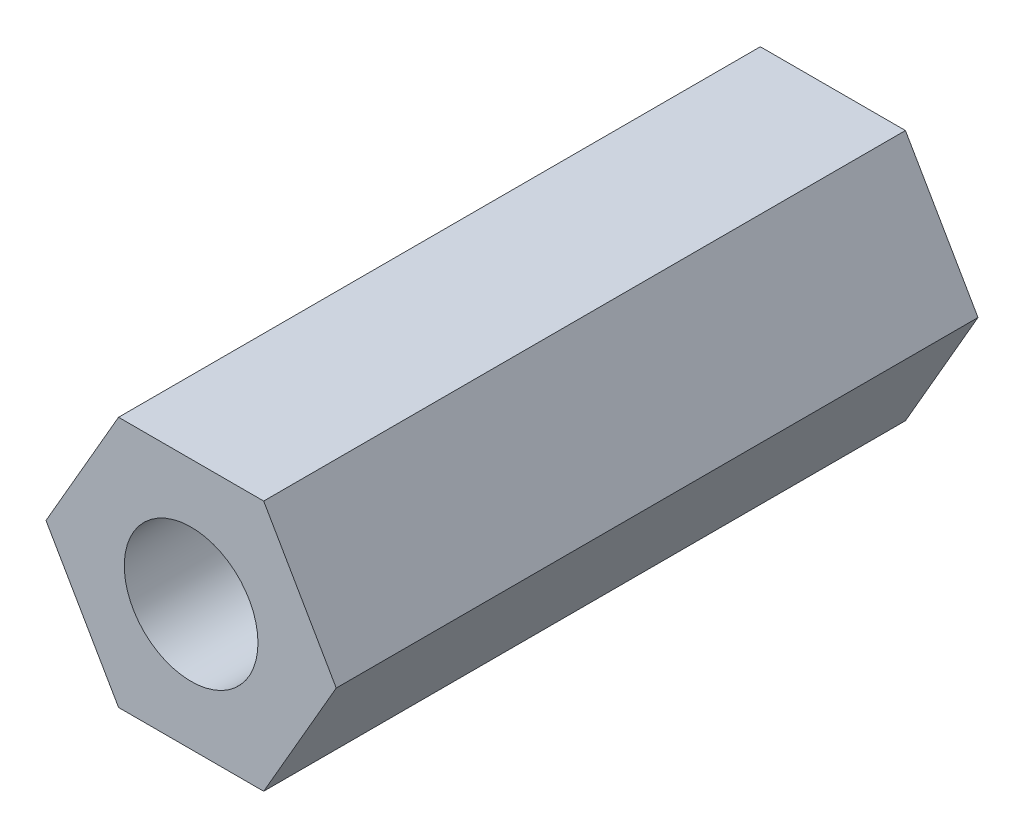
ISO-10303-21;
HEADER;
FILE_DESCRIPTION(('STEP AP214'),'2;1');
FILE_NAME('part.step','',(''),(''),'','','');
FILE_SCHEMA(('AUTOMOTIVE_DESIGN { 1 0 10303 214 1 1 1 1 }'));
ENDSEC;
DATA;
#1=APPLICATION_CONTEXT('core data for automotive mechanical design processes');
#2=APPLICATION_PROTOCOL_DEFINITION('international standard','automotive_design',2000,#1);
#3=PRODUCT_CONTEXT('',#1,'mechanical');
#4=PRODUCT('Part','Part','',(#3));
#5=PRODUCT_RELATED_PRODUCT_CATEGORY('part','',(#4));
#6=PRODUCT_DEFINITION_FORMATION('','',#4);
#7=PRODUCT_DEFINITION_CONTEXT('part definition',#1,'design');
#8=PRODUCT_DEFINITION('design','',#6,#7);
#9=PRODUCT_DEFINITION_SHAPE('','',#8);
#10=(LENGTH_UNIT() NAMED_UNIT(*) SI_UNIT(.MILLI.,.METRE.));
#11=(NAMED_UNIT(*) PLANE_ANGLE_UNIT() SI_UNIT($,.RADIAN.));
#12=(NAMED_UNIT(*) SI_UNIT($,.STERADIAN.) SOLID_ANGLE_UNIT());
#13=UNCERTAINTY_MEASURE_WITH_UNIT(LENGTH_MEASURE(1.E-05),#10,'distance_accuracy_value','');
#14=(GEOMETRIC_REPRESENTATION_CONTEXT(3) GLOBAL_UNCERTAINTY_ASSIGNED_CONTEXT((#13)) GLOBAL_UNIT_ASSIGNED_CONTEXT((#10,
#11,#12)) REPRESENTATION_CONTEXT('',''));
#15=CARTESIAN_POINT('',(0.,0.,0.));
#16=DIRECTION('',(0.,0.,1.));
#17=DIRECTION('',(1.,0.,0.));
#18=AXIS2_PLACEMENT_3D('',#15,#16,#17);
#19=CARTESIAN_POINT('',(0.,0.,12.));
#20=DIRECTION('',(0.,0.,1.));
#21=DIRECTION('',(1.,0.,0.));
#22=AXIS2_PLACEMENT_3D('',#19,#20,#21);
#23=PLANE('',#22);
#24=DIRECTION('',(0.499999999999995,0.866025403784441,0.));
#25=VECTOR('',#24,1.);
#26=CARTESIAN_POINT('',(1.35677313259565,-2.34999999999998,12.));
#27=LINE('',#26,#25);
#28=CARTESIAN_POINT('',(1.35677313259565,-2.34999999999998,12.));
#29=VERTEX_POINT('',#28);
#30=CARTESIAN_POINT('',(2.71354626519124,0.,12.));
#31=VERTEX_POINT('',#30);
#32=EDGE_CURVE('E129',#29,#31,#27,.T.);
#33=ORIENTED_EDGE('',*,*,#32,.T.);
#34=DIRECTION('',(-0.500000000000001,0.866025403784438,0.));
#35=VECTOR('',#34,1.);
#36=CARTESIAN_POINT('',(2.71354626519124,0.,12.));
#37=LINE('',#36,#35);
#38=CARTESIAN_POINT('',(1.35677313259561,2.35,12.));
#39=VERTEX_POINT('',#38);
#40=EDGE_CURVE('E87',#31,#39,#37,.T.);
#41=ORIENTED_EDGE('',*,*,#40,.T.);
#42=DIRECTION('',(-1.,0.,0.));
#43=VECTOR('',#42,1.);
#44=CARTESIAN_POINT('',(1.35677313259561,2.35,12.));
#45=LINE('',#44,#43);
#46=CARTESIAN_POINT('',(-1.35677313259563,2.34999999999999,12.));
#47=VERTEX_POINT('',#46);
#48=EDGE_CURVE('E100',#39,#47,#45,.T.);
#49=ORIENTED_EDGE('',*,*,#48,.T.);
#50=DIRECTION('',(-0.499999999999995,-0.866025403784441,0.));
#51=VECTOR('',#50,1.);
#52=CARTESIAN_POINT('',(-1.35677313259563,2.34999999999999,12.));
#53=LINE('',#52,#51);
#54=CARTESIAN_POINT('',(-2.71354626519124,0.,12.));
#55=VERTEX_POINT('',#54);
#56=EDGE_CURVE('E94',#47,#55,#53,.T.);
#57=ORIENTED_EDGE('',*,*,#56,.T.);
#58=DIRECTION('',(0.500000000000007,-0.866025403784435,0.));
#59=VECTOR('',#58,1.);
#60=CARTESIAN_POINT('',(-2.71354626519124,0.,12.));
#61=LINE('',#60,#59);
#62=CARTESIAN_POINT('',(-1.3567731325956,-2.35000000000001,12.));
#63=VERTEX_POINT('',#62);
#64=EDGE_CURVE('E98',#55,#63,#61,.T.);
#65=ORIENTED_EDGE('',*,*,#64,.T.);
#66=DIRECTION('',(1.,0.,0.));
#67=VECTOR('',#66,1.);
#68=CARTESIAN_POINT('',(-1.3567731325956,-2.35000000000001,12.));
#69=LINE('',#68,#67);
#70=EDGE_CURVE('E50',#63,#29,#69,.T.);
#71=ORIENTED_EDGE('',*,*,#70,.T.);
#72=EDGE_LOOP('',(#33,#41,#49,#57,#65,#71));
#73=FACE_BOUND('',#72,.T.);
#74=CARTESIAN_POINT('',(0.,0.,12.));
#75=DIRECTION('',(0.,0.,1.));
#76=DIRECTION('',(1.,0.,0.));
#77=AXIS2_PLACEMENT_3D('',#74,#75,#76);
#78=CIRCLE('',#77,1.25);
#79=CARTESIAN_POINT('',(1.25,0.,12.));
#80=VERTEX_POINT('',#79);
#81=EDGE_CURVE('E122',#80,#80,#78,.T.);
#82=ORIENTED_EDGE('',*,*,#81,.F.);
#83=EDGE_LOOP('',(#82));
#84=FACE_BOUND('',#83,.T.);
#85=ADVANCED_FACE('F33',(#73,#84),#23,.T.);
#86=CARTESIAN_POINT('',(0.,0.,0.));
#87=DIRECTION('',(0.,0.,1.));
#88=DIRECTION('',(1.,0.,0.));
#89=AXIS2_PLACEMENT_3D('',#86,#87,#88);
#90=PLANE('',#89);
#91=DIRECTION('',(0.499999999999995,0.866025403784441,0.));
#92=VECTOR('',#91,1.);
#93=CARTESIAN_POINT('',(1.35677313259565,-2.34999999999998,0.));
#94=LINE('',#93,#92);
#95=CARTESIAN_POINT('',(1.35677313259565,-2.34999999999998,0.));
#96=VERTEX_POINT('',#95);
#97=CARTESIAN_POINT('',(2.71354626519124,0.,0.));
#98=VERTEX_POINT('',#97);
#99=EDGE_CURVE('E118',#96,#98,#94,.T.);
#100=ORIENTED_EDGE('',*,*,#99,.F.);
#101=DIRECTION('',(1.,0.,0.));
#102=VECTOR('',#101,1.);
#103=CARTESIAN_POINT('',(-1.3567731325956,-2.35000000000001,0.));
#104=LINE('',#103,#102);
#105=CARTESIAN_POINT('',(-1.3567731325956,-2.35000000000001,0.));
#106=VERTEX_POINT('',#105);
#107=EDGE_CURVE('E79',#106,#96,#104,.T.);
#108=ORIENTED_EDGE('',*,*,#107,.F.);
#109=DIRECTION('',(0.500000000000007,-0.866025403784435,0.));
#110=VECTOR('',#109,1.);
#111=CARTESIAN_POINT('',(-2.71354626519124,0.,0.));
#112=LINE('',#111,#110);
#113=CARTESIAN_POINT('',(-2.71354626519124,0.,0.));
#114=VERTEX_POINT('',#113);
#115=EDGE_CURVE('E73',#114,#106,#112,.T.);
#116=ORIENTED_EDGE('',*,*,#115,.F.);
#117=DIRECTION('',(-0.499999999999995,-0.866025403784441,0.));
#118=VECTOR('',#117,1.);
#119=CARTESIAN_POINT('',(-1.35677313259563,2.34999999999999,0.));
#120=LINE('',#119,#118);
#121=CARTESIAN_POINT('',(-1.35677313259563,2.34999999999999,0.));
#122=VERTEX_POINT('',#121);
#123=EDGE_CURVE('E108',#122,#114,#120,.T.);
#124=ORIENTED_EDGE('',*,*,#123,.F.);
#125=DIRECTION('',(-1.,0.,0.));
#126=VECTOR('',#125,1.);
#127=CARTESIAN_POINT('',(1.35677313259561,2.35,0.));
#128=LINE('',#127,#126);
#129=CARTESIAN_POINT('',(1.35677313259561,2.35,0.));
#130=VERTEX_POINT('',#129);
#131=EDGE_CURVE('E124',#130,#122,#128,.T.);
#132=ORIENTED_EDGE('',*,*,#131,.F.);
#133=DIRECTION('',(-0.500000000000001,0.866025403784438,0.));
#134=VECTOR('',#133,1.);
#135=CARTESIAN_POINT('',(2.71354626519124,0.,0.));
#136=LINE('',#135,#134);
#137=EDGE_CURVE('E121',#98,#130,#136,.T.);
#138=ORIENTED_EDGE('',*,*,#137,.F.);
#139=EDGE_LOOP('',(#100,#108,#116,#124,#132,#138));
#140=FACE_BOUND('',#139,.T.);
#141=CARTESIAN_POINT('',(0.,0.,0.));
#142=DIRECTION('',(0.,0.,1.));
#143=DIRECTION('',(1.,0.,0.));
#144=AXIS2_PLACEMENT_3D('',#141,#142,#143);
#145=CIRCLE('',#144,1.25);
#146=CARTESIAN_POINT('',(1.25,0.,0.));
#147=VERTEX_POINT('',#146);
#148=EDGE_CURVE('E222',#147,#147,#145,.T.);
#149=ORIENTED_EDGE('',*,*,#148,.T.);
#150=EDGE_LOOP('',(#149));
#151=FACE_BOUND('',#150,.T.);
#152=ADVANCED_FACE('F138',(#140,#151),#90,.F.);
#153=CARTESIAN_POINT('',(1.35677313259565,-2.34999999999998,12.));
#154=DIRECTION('',(-0.866025403784441,0.499999999999995,0.));
#155=DIRECTION('',(-0.499999999999995,-0.866025403784442,0.));
#156=AXIS2_PLACEMENT_3D('',#153,#154,#155);
#157=PLANE('',#156);
#158=ORIENTED_EDGE('',*,*,#99,.T.);
#159=DIRECTION('',(0.,0.,-1.));
#160=VECTOR('',#159,1.);
#161=CARTESIAN_POINT('',(2.71354626519124,0.,12.));
#162=LINE('',#161,#160);
#163=EDGE_CURVE('E11',#31,#98,#162,.T.);
#164=ORIENTED_EDGE('',*,*,#163,.F.);
#165=ORIENTED_EDGE('',*,*,#32,.F.);
#166=DIRECTION('',(0.,0.,-1.));
#167=VECTOR('',#166,1.);
#168=CARTESIAN_POINT('',(1.35677313259565,-2.34999999999998,12.));
#169=LINE('',#168,#167);
#170=EDGE_CURVE('E114',#29,#96,#169,.T.);
#171=ORIENTED_EDGE('',*,*,#170,.T.);
#172=EDGE_LOOP('',(#158,#164,#165,#171));
#173=FACE_BOUND('',#172,.T.);
#174=ADVANCED_FACE('F35',(#173),#157,.F.);
#175=CARTESIAN_POINT('',(2.71354626519124,0.,12.));
#176=DIRECTION('',(-0.866025403784438,-0.500000000000001,0.));
#177=DIRECTION('',(0.500000000000001,-0.866025403784438,0.));
#178=AXIS2_PLACEMENT_3D('',#175,#176,#177);
#179=PLANE('',#178);
#180=ORIENTED_EDGE('',*,*,#137,.T.);
#181=DIRECTION('',(0.,0.,-1.));
#182=VECTOR('',#181,1.);
#183=CARTESIAN_POINT('',(1.35677313259561,2.35,12.));
#184=LINE('',#183,#182);
#185=EDGE_CURVE('E42',#39,#130,#184,.T.);
#186=ORIENTED_EDGE('',*,*,#185,.F.);
#187=ORIENTED_EDGE('',*,*,#40,.F.);
#188=ORIENTED_EDGE('',*,*,#163,.T.);
#189=EDGE_LOOP('',(#180,#186,#187,#188));
#190=FACE_BOUND('',#189,.T.);
#191=ADVANCED_FACE('F163',(#190),#179,.F.);
#192=CARTESIAN_POINT('',(1.35677313259561,2.35,12.));
#193=DIRECTION('',(0.,-1.,0.));
#194=DIRECTION('',(1.,0.,0.));
#195=AXIS2_PLACEMENT_3D('',#192,#193,#194);
#196=PLANE('',#195);
#197=ORIENTED_EDGE('',*,*,#131,.T.);
#198=DIRECTION('',(0.,0.,-1.));
#199=VECTOR('',#198,1.);
#200=CARTESIAN_POINT('',(-1.35677313259563,2.34999999999999,12.));
#201=LINE('',#200,#199);
#202=EDGE_CURVE('E109',#47,#122,#201,.T.);
#203=ORIENTED_EDGE('',*,*,#202,.F.);
#204=ORIENTED_EDGE('',*,*,#48,.F.);
#205=ORIENTED_EDGE('',*,*,#185,.T.);
#206=EDGE_LOOP('',(#197,#203,#204,#205));
#207=FACE_BOUND('',#206,.T.);
#208=ADVANCED_FACE('F135',(#207),#196,.F.);
#209=CARTESIAN_POINT('',(-1.35677313259563,2.34999999999999,12.));
#210=DIRECTION('',(0.866025403784441,-0.499999999999995,0.));
#211=DIRECTION('',(0.499999999999995,0.866025403784441,0.));
#212=AXIS2_PLACEMENT_3D('',#209,#210,#211);
#213=PLANE('',#212);
#214=ORIENTED_EDGE('',*,*,#123,.T.);
#215=DIRECTION('',(0.,0.,-1.));
#216=VECTOR('',#215,1.);
#217=CARTESIAN_POINT('',(-2.71354626519124,0.,12.));
#218=LINE('',#217,#216);
#219=EDGE_CURVE('E105',#55,#114,#218,.T.);
#220=ORIENTED_EDGE('',*,*,#219,.F.);
#221=ORIENTED_EDGE('',*,*,#56,.F.);
#222=ORIENTED_EDGE('',*,*,#202,.T.);
#223=EDGE_LOOP('',(#214,#220,#221,#222));
#224=FACE_BOUND('',#223,.T.);
#225=ADVANCED_FACE('F106',(#224),#213,.F.);
#226=CARTESIAN_POINT('',(-2.71354626519124,0.,12.));
#227=DIRECTION('',(0.866025403784434,0.500000000000007,0.));
#228=DIRECTION('',(-0.500000000000007,0.866025403784435,0.));
#229=AXIS2_PLACEMENT_3D('',#226,#227,#228);
#230=PLANE('',#229);
#231=ORIENTED_EDGE('',*,*,#115,.T.);
#232=DIRECTION('',(0.,0.,-1.));
#233=VECTOR('',#232,1.);
#234=CARTESIAN_POINT('',(-1.3567731325956,-2.35000000000001,12.));
#235=LINE('',#234,#233);
#236=EDGE_CURVE('E110',#63,#106,#235,.T.);
#237=ORIENTED_EDGE('',*,*,#236,.F.);
#238=ORIENTED_EDGE('',*,*,#64,.F.);
#239=ORIENTED_EDGE('',*,*,#219,.T.);
#240=EDGE_LOOP('',(#231,#237,#238,#239));
#241=FACE_BOUND('',#240,.T.);
#242=ADVANCED_FACE('F112',(#241),#230,.F.);
#243=CARTESIAN_POINT('',(-1.3567731325956,-2.35000000000001,12.));
#244=DIRECTION('',(0.,1.,0.));
#245=DIRECTION('',(-1.,0.,0.));
#246=AXIS2_PLACEMENT_3D('',#243,#244,#245);
#247=PLANE('',#246);
#248=ORIENTED_EDGE('',*,*,#107,.T.);
#249=ORIENTED_EDGE('',*,*,#170,.F.);
#250=ORIENTED_EDGE('',*,*,#70,.F.);
#251=ORIENTED_EDGE('',*,*,#236,.T.);
#252=EDGE_LOOP('',(#248,#249,#250,#251));
#253=FACE_BOUND('',#252,.T.);
#254=ADVANCED_FACE('F143',(#253),#247,.F.);
#255=CARTESIAN_POINT('',(0.,0.,12.));
#256=DIRECTION('',(0.,0.,-1.));
#257=DIRECTION('',(-1.,0.,0.));
#258=AXIS2_PLACEMENT_3D('',#255,#256,#257);
#259=CYLINDRICAL_SURFACE('',#258,1.25);
#260=ORIENTED_EDGE('',*,*,#81,.T.);
#261=EDGE_LOOP('',(#260));
#262=FACE_BOUND('',#261,.T.);
#263=ORIENTED_EDGE('',*,*,#148,.F.);
#264=EDGE_LOOP('',(#263));
#265=FACE_BOUND('',#264,.T.);
#266=ADVANCED_FACE('F145',(#262,#265),#259,.F.);
#267=CLOSED_SHELL('',(#85,#152,#174,#191,#208,#225,#242,#254,#266));
#268=MANIFOLD_SOLID_BREP('B2',#267);
#269=ADVANCED_BREP_SHAPE_REPRESENTATION('',(#18,#268),#14);
#270=SHAPE_DEFINITION_REPRESENTATION(#9,#269);
ENDSEC;
END-ISO-10303-21;
